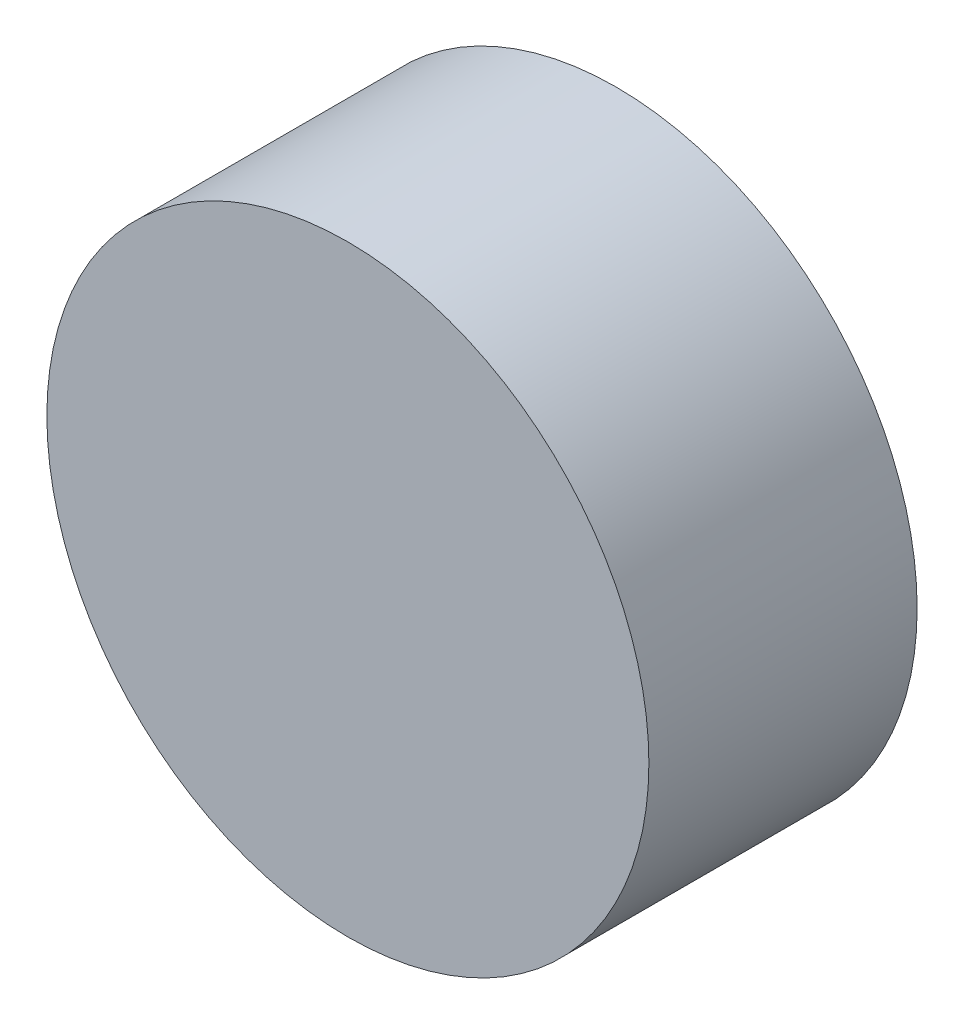
ISO-10303-21;
HEADER;
FILE_DESCRIPTION(('STEP AP214'),'2;1');
FILE_NAME('part.step','',(''),(''),'','','');
FILE_SCHEMA(('AUTOMOTIVE_DESIGN { 1 0 10303 214 1 1 1 1 }'));
ENDSEC;
DATA;
#1=APPLICATION_CONTEXT('core data for automotive mechanical design processes');
#2=APPLICATION_PROTOCOL_DEFINITION('international standard','automotive_design',2000,#1);
#3=PRODUCT_CONTEXT('',#1,'mechanical');
#4=PRODUCT('Part','Part','',(#3));
#5=PRODUCT_RELATED_PRODUCT_CATEGORY('part','',(#4));
#6=PRODUCT_DEFINITION_FORMATION('','',#4);
#7=PRODUCT_DEFINITION_CONTEXT('part definition',#1,'design');
#8=PRODUCT_DEFINITION('design','',#6,#7);
#9=PRODUCT_DEFINITION_SHAPE('','',#8);
#10=(LENGTH_UNIT() NAMED_UNIT(*) SI_UNIT(.MILLI.,.METRE.));
#11=(NAMED_UNIT(*) PLANE_ANGLE_UNIT() SI_UNIT($,.RADIAN.));
#12=(NAMED_UNIT(*) SI_UNIT($,.STERADIAN.) SOLID_ANGLE_UNIT());
#13=UNCERTAINTY_MEASURE_WITH_UNIT(LENGTH_MEASURE(1.E-05),#10,'distance_accuracy_value','');
#14=(GEOMETRIC_REPRESENTATION_CONTEXT(3) GLOBAL_UNCERTAINTY_ASSIGNED_CONTEXT((#13)) GLOBAL_UNIT_ASSIGNED_CONTEXT((#10,
#11,#12)) REPRESENTATION_CONTEXT('',''));
#15=CARTESIAN_POINT('',(0.,0.,0.));
#16=DIRECTION('',(0.,0.,1.));
#17=DIRECTION('',(1.,0.,0.));
#18=AXIS2_PLACEMENT_3D('',#15,#16,#17);
#19=CARTESIAN_POINT('',(0.,0.,0.80199992));
#20=DIRECTION('',(0.,0.,1.));
#21=DIRECTION('',(1.,0.,0.));
#22=AXIS2_PLACEMENT_3D('',#19,#20,#21);
#23=PLANE('',#22);
#24=CARTESIAN_POINT('',(0.,0.,0.80199992));
#25=DIRECTION('',(0.,0.,1.));
#26=DIRECTION('',(1.,0.,0.));
#27=AXIS2_PLACEMENT_3D('',#24,#25,#26);
#28=CIRCLE('',#27,0.90000074);
#29=CARTESIAN_POINT('',(-0.90000074,0.,0.80199992));
#30=VERTEX_POINT('',#29);
#31=EDGE_CURVE('E11',#30,#30,#28,.T.);
#32=ORIENTED_EDGE('',*,*,#31,.T.);
#33=EDGE_LOOP('',(#32));
#34=FACE_BOUND('',#33,.T.);
#35=ADVANCED_FACE('F16',(#34),#23,.T.);
#36=CARTESIAN_POINT('',(0.,0.,0.));
#37=DIRECTION('',(0.,0.,1.));
#38=DIRECTION('',(1.,0.,0.));
#39=AXIS2_PLACEMENT_3D('',#36,#37,#38);
#40=PLANE('',#39);
#41=CARTESIAN_POINT('',(0.,0.,0.));
#42=DIRECTION('',(0.,0.,1.));
#43=DIRECTION('',(1.,0.,0.));
#44=AXIS2_PLACEMENT_3D('',#41,#42,#43);
#45=CIRCLE('',#44,0.90000074);
#46=CARTESIAN_POINT('',(-0.90000074,0.,0.));
#47=VERTEX_POINT('',#46);
#48=EDGE_CURVE('E41',#47,#47,#45,.T.);
#49=ORIENTED_EDGE('',*,*,#48,.F.);
#50=EDGE_LOOP('',(#49));
#51=FACE_BOUND('',#50,.T.);
#52=ADVANCED_FACE('F60',(#51),#40,.F.);
#53=CARTESIAN_POINT('',(0.,0.,0.));
#54=DIRECTION('',(0.,0.,-1.));
#55=DIRECTION('',(1.,0.,0.));
#56=AXIS2_PLACEMENT_3D('',#53,#54,#55);
#57=CYLINDRICAL_SURFACE('',#56,0.90000074);
#58=ORIENTED_EDGE('',*,*,#48,.T.);
#59=DIRECTION('',(0.,0.,1.));
#60=VECTOR('',#59,1.);
#61=CARTESIAN_POINT('',(-0.90000074,0.,0.));
#62=LINE('',#61,#60);
#63=EDGE_CURVE('E20',#47,#30,#62,.T.);
#64=ORIENTED_EDGE('',*,*,#63,.T.);
#65=ORIENTED_EDGE('',*,*,#31,.F.);
#66=ORIENTED_EDGE('',*,*,#63,.F.);
#67=EDGE_LOOP('',(#58,#64,#65,#66));
#68=FACE_BOUND('',#67,.T.);
#69=ADVANCED_FACE('F18',(#68),#57,.T.);
#70=CLOSED_SHELL('',(#35,#52,#69));
#71=MANIFOLD_SOLID_BREP('B1',#70);
#72=ADVANCED_BREP_SHAPE_REPRESENTATION('',(#18,#71),#14);
#73=SHAPE_DEFINITION_REPRESENTATION(#9,#72);
ENDSEC;
END-ISO-10303-21;
